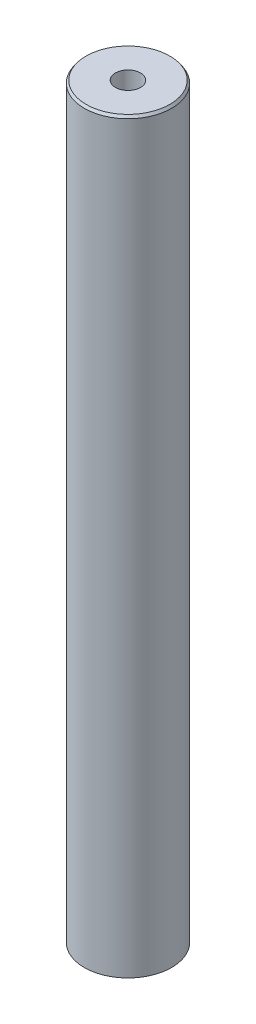
ISO-10303-21;
HEADER;
FILE_DESCRIPTION(('STEP AP214'),'2;1');
FILE_NAME('part.step','',(''),(''),'','','');
FILE_SCHEMA(('AUTOMOTIVE_DESIGN { 1 0 10303 214 1 1 1 1 }'));
ENDSEC;
DATA;
#1=APPLICATION_CONTEXT('core data for automotive mechanical design processes');
#2=APPLICATION_PROTOCOL_DEFINITION('international standard','automotive_design',2000,#1);
#3=PRODUCT_CONTEXT('',#1,'mechanical');
#4=PRODUCT('Part','Part','',(#3));
#5=PRODUCT_RELATED_PRODUCT_CATEGORY('part','',(#4));
#6=PRODUCT_DEFINITION_FORMATION('','',#4);
#7=PRODUCT_DEFINITION_CONTEXT('part definition',#1,'design');
#8=PRODUCT_DEFINITION('design','',#6,#7);
#9=PRODUCT_DEFINITION_SHAPE('','',#8);
#10=(LENGTH_UNIT() NAMED_UNIT(*) SI_UNIT(.MILLI.,.METRE.));
#11=(NAMED_UNIT(*) PLANE_ANGLE_UNIT() SI_UNIT($,.RADIAN.));
#12=(NAMED_UNIT(*) SI_UNIT($,.STERADIAN.) SOLID_ANGLE_UNIT());
#13=UNCERTAINTY_MEASURE_WITH_UNIT(LENGTH_MEASURE(1.E-05),#10,'distance_accuracy_value','');
#14=(GEOMETRIC_REPRESENTATION_CONTEXT(3) GLOBAL_UNCERTAINTY_ASSIGNED_CONTEXT((#13)) GLOBAL_UNIT_ASSIGNED_CONTEXT((#10,
#11,#12)) REPRESENTATION_CONTEXT('',''));
#15=CARTESIAN_POINT('',(0.,0.,0.));
#16=DIRECTION('',(0.,0.,1.));
#17=DIRECTION('',(1.,0.,0.));
#18=AXIS2_PLACEMENT_3D('',#15,#16,#17);
#19=CARTESIAN_POINT('',(0.,600.,0.));
#20=DIRECTION('',(0.,-1.,0.));
#21=DIRECTION('',(0.,0.,-1.));
#22=AXIS2_PLACEMENT_3D('',#19,#20,#21);
#23=CYLINDRICAL_SURFACE('',#22,35.);
#24=CARTESIAN_POINT('',(0.,597.967627894586,0.));
#25=DIRECTION('',(0.,1.,0.));
#26=DIRECTION('',(0.,0.,1.));
#27=AXIS2_PLACEMENT_3D('',#24,#25,#26);
#28=CIRCLE('',#27,35.);
#29=CARTESIAN_POINT('',(0.,597.967627894586,35.));
#30=VERTEX_POINT('',#29);
#31=EDGE_CURVE('E50',#30,#30,#28,.F.);
#32=ORIENTED_EDGE('',*,*,#31,.T.);
#33=EDGE_LOOP('',(#32));
#34=FACE_BOUND('',#33,.T.);
#35=CARTESIAN_POINT('',(0.,1.4147026893252,0.));
#36=DIRECTION('',(0.,1.,0.));
#37=DIRECTION('',(0.,0.,1.));
#38=AXIS2_PLACEMENT_3D('',#35,#36,#37);
#39=CIRCLE('',#38,35.);
#40=CARTESIAN_POINT('',(0.,1.4147026893252,35.));
#41=VERTEX_POINT('',#40);
#42=EDGE_CURVE('E51',#41,#41,#39,.T.);
#43=ORIENTED_EDGE('',*,*,#42,.T.);
#44=EDGE_LOOP('',(#43));
#45=FACE_BOUND('',#44,.T.);
#46=ADVANCED_FACE('F39',(#34,#45),#23,.T.);
#47=CARTESIAN_POINT('',(0.,600.,0.));
#48=DIRECTION('',(0.,1.,0.));
#49=DIRECTION('',(0.,0.,1.));
#50=AXIS2_PLACEMENT_3D('',#47,#48,#49);
#51=PLANE('',#50);
#52=CARTESIAN_POINT('',(0.,600.,0.));
#53=DIRECTION('',(0.,1.,0.));
#54=DIRECTION('',(0.,0.,1.));
#55=AXIS2_PLACEMENT_3D('',#52,#53,#54);
#56=CIRCLE('',#55,33.5852973106746);
#57=CARTESIAN_POINT('',(0.,600.,33.5852973106746));
#58=VERTEX_POINT('',#57);
#59=EDGE_CURVE('E54',#58,#58,#56,.T.);
#60=ORIENTED_EDGE('',*,*,#59,.T.);
#61=EDGE_LOOP('',(#60));
#62=FACE_BOUND('',#61,.T.);
#63=CARTESIAN_POINT('',(0.,600.,0.));
#64=DIRECTION('',(0.,1.,0.));
#65=DIRECTION('',(0.,0.,1.));
#66=AXIS2_PLACEMENT_3D('',#63,#64,#65);
#67=CIRCLE('',#66,10.0819327343866);
#68=CARTESIAN_POINT('',(0.,600.,10.0819327343866));
#69=VERTEX_POINT('',#68);
#70=EDGE_CURVE('E58',#69,#69,#67,.T.);
#71=ORIENTED_EDGE('',*,*,#70,.F.);
#72=EDGE_LOOP('',(#71));
#73=FACE_BOUND('',#72,.T.);
#74=ADVANCED_FACE('F69',(#62,#73),#51,.T.);
#75=CARTESIAN_POINT('',(0.,0.,0.));
#76=DIRECTION('',(0.,1.,0.));
#77=DIRECTION('',(0.,0.,1.));
#78=AXIS2_PLACEMENT_3D('',#75,#76,#77);
#79=PLANE('',#78);
#80=CARTESIAN_POINT('',(0.,0.,0.));
#81=DIRECTION('',(0.,1.,0.));
#82=DIRECTION('',(0.,0.,1.));
#83=AXIS2_PLACEMENT_3D('',#80,#81,#82);
#84=CIRCLE('',#83,32.967627894586);
#85=CARTESIAN_POINT('',(0.,0.,32.967627894586));
#86=VERTEX_POINT('',#85);
#87=EDGE_CURVE('E10',#86,#86,#84,.F.);
#88=ORIENTED_EDGE('',*,*,#87,.T.);
#89=EDGE_LOOP('',(#88));
#90=FACE_BOUND('',#89,.T.);
#91=CARTESIAN_POINT('',(0.,0.,0.));
#92=DIRECTION('',(0.,1.,0.));
#93=DIRECTION('',(0.,0.,1.));
#94=AXIS2_PLACEMENT_3D('',#91,#92,#93);
#95=CIRCLE('',#94,10.0819327343866);
#96=CARTESIAN_POINT('',(0.,0.,10.0819327343866));
#97=VERTEX_POINT('',#96);
#98=EDGE_CURVE('E63',#97,#97,#95,.T.);
#99=ORIENTED_EDGE('',*,*,#98,.T.);
#100=EDGE_LOOP('',(#99));
#101=FACE_BOUND('',#100,.T.);
#102=ADVANCED_FACE('F75',(#90,#101),#79,.F.);
#103=CARTESIAN_POINT('',(0.,600.,0.));
#104=DIRECTION('',(0.,-1.,0.));
#105=DIRECTION('',(0.,0.,-1.));
#106=AXIS2_PLACEMENT_3D('',#103,#104,#105);
#107=CYLINDRICAL_SURFACE('',#106,10.0819327343866);
#108=ORIENTED_EDGE('',*,*,#70,.T.);
#109=EDGE_LOOP('',(#108));
#110=FACE_BOUND('',#109,.T.);
#111=ORIENTED_EDGE('',*,*,#98,.F.);
#112=EDGE_LOOP('',(#111));
#113=FACE_BOUND('',#112,.T.);
#114=ADVANCED_FACE('F70',(#110,#113),#107,.F.);
#115=CARTESIAN_POINT('',(0.,600.,0.));
#116=DIRECTION('',(0.,-1.,0.));
#117=DIRECTION('',(0.,0.,-1.));
#118=AXIS2_PLACEMENT_3D('',#115,#116,#117);
#119=CONICAL_SURFACE('',#118,33.5852973106746,0.608093264852997);
#120=ORIENTED_EDGE('',*,*,#31,.F.);
#121=EDGE_LOOP('',(#120));
#122=FACE_BOUND('',#121,.T.);
#123=ORIENTED_EDGE('',*,*,#59,.F.);
#124=EDGE_LOOP('',(#123));
#125=FACE_BOUND('',#124,.T.);
#126=ADVANCED_FACE('F81',(#122,#125),#119,.T.);
#127=CARTESIAN_POINT('',(0.,1.4147026893252,0.));
#128=DIRECTION('',(0.,1.,0.));
#129=DIRECTION('',(0.,0.,1.));
#130=AXIS2_PLACEMENT_3D('',#127,#128,#129);
#131=CONICAL_SURFACE('',#130,35.,0.96270306194191);
#132=CARTESIAN_POINT('',(0.,0.,32.967627894586));
#133=CARTESIAN_POINT('',(0.,0.0147364863471373,32.9887984373507));
#134=CARTESIAN_POINT('',(0.,0.0294729726942748,33.0099689801154));
#135=CARTESIAN_POINT('',(0.,0.0589459453885497,33.0523100656449));
#136=CARTESIAN_POINT('',(0.,0.0736824317356871,33.0734806084096));
#137=CARTESIAN_POINT('',(0.,0.103155404429962,33.1158216939391));
#138=CARTESIAN_POINT('',(0.,0.1178918907771,33.1369922367038));
#139=CARTESIAN_POINT('',(0.,0.147364863471374,33.1793333222333));
#140=CARTESIAN_POINT('',(0.,0.162101349818511,33.200503864998));
#141=CARTESIAN_POINT('',(0.,0.191574322512787,33.2428449505274));
#142=CARTESIAN_POINT('',(0.,0.206310808859925,33.2640154932922));
#143=CARTESIAN_POINT('',(0.,0.2357837815542,33.3063565788216));
#144=CARTESIAN_POINT('',(0.,0.250520267901337,33.3275271215864));
#145=CARTESIAN_POINT('',(0.,0.279993240595612,33.3698682071158));
#146=CARTESIAN_POINT('',(0.,0.294729726942749,33.3910387498806));
#147=CARTESIAN_POINT('',(0.,0.324202699637024,33.43337983541));
#148=CARTESIAN_POINT('',(0.,0.338939185984162,33.4545503781747));
#149=CARTESIAN_POINT('',(0.,0.368412158678437,33.4968914637042));
#150=CARTESIAN_POINT('',(0.,0.383148645025574,33.5180620064689));
#151=CARTESIAN_POINT('',(0.,0.412621617719849,33.5604030919984));
#152=CARTESIAN_POINT('',(0.,0.427358104066987,33.5815736347631));
#153=CARTESIAN_POINT('',(0.,0.456831076761262,33.6239147202926));
#154=CARTESIAN_POINT('',(0.,0.471567563108399,33.6450852630573));
#155=CARTESIAN_POINT('',(0.,0.501040535802674,33.6874263485868));
#156=CARTESIAN_POINT('',(0.,0.515777022149812,33.7085968913515));
#157=CARTESIAN_POINT('',(0.,0.545249994844087,33.750937976881));
#158=CARTESIAN_POINT('',(0.,0.559986481191224,33.7721085196457));
#159=CARTESIAN_POINT('',(0.,0.589459453885499,33.8144496051751));
#160=CARTESIAN_POINT('',(0.,0.604195940232637,33.8356201479399));
#161=CARTESIAN_POINT('',(0.,0.633668912926911,33.8779612334693));
#162=CARTESIAN_POINT('',(0.,0.648405399274048,33.8991317762341));
#163=CARTESIAN_POINT('',(0.,0.677878371968323,33.9414728617635));
#164=CARTESIAN_POINT('',(0.,0.692614858315462,33.9626434045283));
#165=CARTESIAN_POINT('',(0.,0.722087831009737,34.0049844900577));
#166=CARTESIAN_POINT('',(0.,0.736824317356874,34.0261550328224));
#167=CARTESIAN_POINT('',(0.,0.766297290051149,34.0684961183519));
#168=CARTESIAN_POINT('',(0.,0.781033776398286,34.0896666611166));
#169=CARTESIAN_POINT('',(0.,0.810506749092561,34.1320077466461));
#170=CARTESIAN_POINT('',(0.,0.825243235439699,34.1531782894108));
#171=CARTESIAN_POINT('',(0.,0.854716208133974,34.1955193749403));
#172=CARTESIAN_POINT('',(0.,0.869452694481111,34.216689917705));
#173=CARTESIAN_POINT('',(0.,0.898925667175386,34.2590310032345));
#174=CARTESIAN_POINT('',(0.,0.913662153522524,34.2802015459992));
#175=CARTESIAN_POINT('',(0.,0.943135126216799,34.3225426315287));
#176=CARTESIAN_POINT('',(0.,0.957871612563936,34.3437131742934));
#177=CARTESIAN_POINT('',(0.,0.987344585258211,34.3860542598228));
#178=CARTESIAN_POINT('',(0.,1.00208107160535,34.4072248025876));
#179=CARTESIAN_POINT('',(0.,1.03155404429962,34.449565888117));
#180=CARTESIAN_POINT('',(0.,1.04629053064676,34.4707364308818));
#181=CARTESIAN_POINT('',(0.,1.07576350334104,34.5130775164112));
#182=CARTESIAN_POINT('',(0.,1.09049998968817,34.534248059176));
#183=CARTESIAN_POINT('',(0.,1.11997296238245,34.5765891447054));
#184=CARTESIAN_POINT('',(0.,1.13470944872959,34.5977596874702));
#185=CARTESIAN_POINT('',(0.,1.16418242142386,34.6401007729996));
#186=CARTESIAN_POINT('',(0.,1.178918907771,34.6612713157643));
#187=CARTESIAN_POINT('',(0.,1.20839188046527,34.7036124012938));
#188=CARTESIAN_POINT('',(0.,1.22312836681241,34.7247829440585));
#189=CARTESIAN_POINT('',(0.,1.25260133950669,34.767124029588));
#190=CARTESIAN_POINT('',(0.,1.26733782585382,34.7882945723527));
#191=CARTESIAN_POINT('',(0.,1.2968107985481,34.8306356578822));
#192=CARTESIAN_POINT('',(0.,1.31154728489524,34.8518062006469));
#193=CARTESIAN_POINT('',(0.,1.34102025758951,34.8941472861764));
#194=CARTESIAN_POINT('',(0.,1.35575674393665,34.9153178289411));
#195=CARTESIAN_POINT('',(0.,1.38522971663092,34.9576589144705));
#196=CARTESIAN_POINT('',(0.,1.39996620297806,34.9788294572353));
#197=CARTESIAN_POINT('',(0.,1.4147026893252,35.));
#198=B_SPLINE_CURVE_WITH_KNOTS('',3,(#132,#133,#134,#135,#136,#137,#138,#139,#140,#141,#142,
#143,#144,#145,#146,#147,#148,#149,#150,#151,#152,#153,#154,#155,#156,#157,#158,#159,#160,#161,
#162,#163,#164,#165,#166,#167,#168,#169,#170,#171,#172,#173,#174,#175,#176,#177,#178,#179,#180,
#181,#182,#183,#184,#185,#186,#187,#188,#189,#190,#191,#192,#193,#194,#195,#196,#197),
.UNSPECIFIED.,.F.,.F.,(4,2,2,2,2,2,2,2,2,2,2,2,2,2,2,2,2,2,2,2,2,2,2,2,2,2,2,2,2,2,2,2,4),(0.,
0.0773834814240975,0.154766962848195,0.232150444272292,0.30953392569639,0.386917407120482,
0.464300888544579,0.541684369968677,0.619067851392774,0.696451332816872,0.773834814240969,
0.851218295665067,0.928601777089165,1.00598525851326,1.08336873993736,1.16075222136146,
1.23813570278555,1.31551918420965,1.39290266563374,1.47028614705784,1.54766962848194,
1.62505310990604,1.70243659133013,1.77982007275423,1.85720355417833,1.93458703560243,
2.01197051702652,2.08935399845062,2.16673747987471,2.24412096129881,2.32150444272291,
2.39888792414701,2.4762714055711),.UNSPECIFIED.);
#199=EDGE_CURVE('BSEAM45',#86,#41,#198,.T.);
#200=ORIENTED_EDGE('',*,*,#87,.F.);
#201=ORIENTED_EDGE('',*,*,#42,.F.);
#202=ORIENTED_EDGE('',*,*,#199,.T.);
#203=ORIENTED_EDGE('',*,*,#199,.F.);
#204=EDGE_LOOP('',(#200,#202,#201,#203));
#205=FACE_BOUND('',#204,.T.);
#206=ADVANCED_FACE('F45',(#205),#131,.T.);
#207=CLOSED_SHELL('',(#46,#74,#102,#114,#126,#206));
#208=MANIFOLD_SOLID_BREP('B2',#207);
#209=ADVANCED_BREP_SHAPE_REPRESENTATION('',(#18,#208),#14);
#210=SHAPE_DEFINITION_REPRESENTATION(#9,#209);
ENDSEC;
END-ISO-10303-21;
